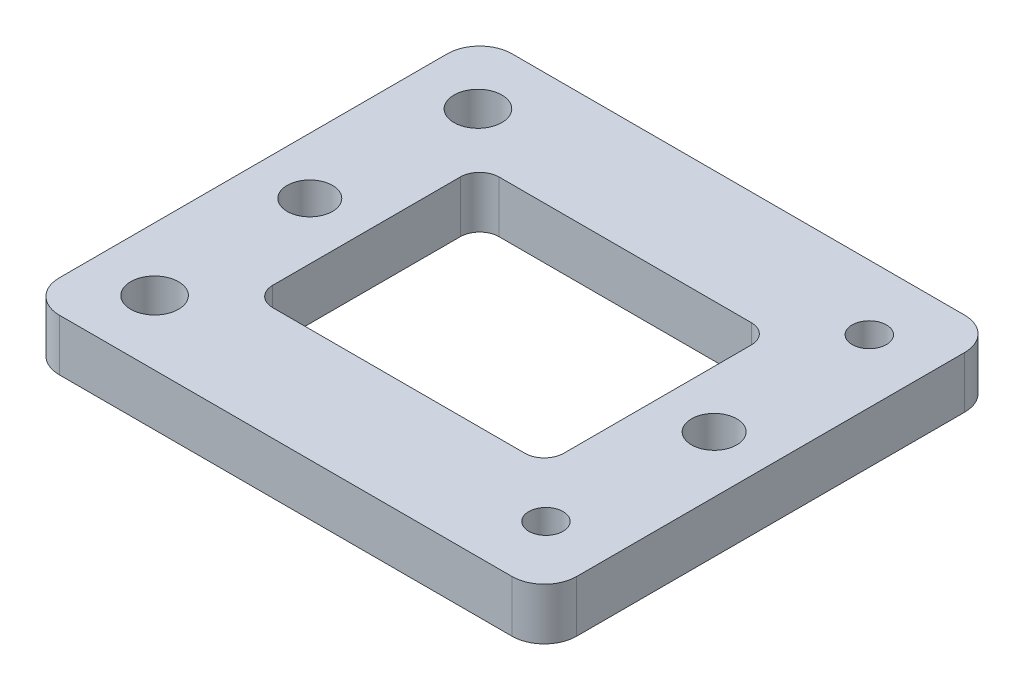
ISO-10303-21;
HEADER;
FILE_DESCRIPTION(('STEP AP214'),'2;1');
FILE_NAME('part.step','',(''),(''),'','','');
FILE_SCHEMA(('AUTOMOTIVE_DESIGN { 1 0 10303 214 1 1 1 1 }'));
ENDSEC;
DATA;
#1=APPLICATION_CONTEXT('core data for automotive mechanical design processes');
#2=APPLICATION_PROTOCOL_DEFINITION('international standard','automotive_design',2000,#1);
#3=PRODUCT_CONTEXT('',#1,'mechanical');
#4=PRODUCT('Part','Part','',(#3));
#5=PRODUCT_RELATED_PRODUCT_CATEGORY('part','',(#4));
#6=PRODUCT_DEFINITION_FORMATION('','',#4);
#7=PRODUCT_DEFINITION_CONTEXT('part definition',#1,'design');
#8=PRODUCT_DEFINITION('design','',#6,#7);
#9=PRODUCT_DEFINITION_SHAPE('','',#8);
#10=(LENGTH_UNIT() NAMED_UNIT(*) SI_UNIT(.MILLI.,.METRE.));
#11=(NAMED_UNIT(*) PLANE_ANGLE_UNIT() SI_UNIT($,.RADIAN.));
#12=(NAMED_UNIT(*) SI_UNIT($,.STERADIAN.) SOLID_ANGLE_UNIT());
#13=UNCERTAINTY_MEASURE_WITH_UNIT(LENGTH_MEASURE(1.E-05),#10,'distance_accuracy_value','');
#14=(GEOMETRIC_REPRESENTATION_CONTEXT(3) GLOBAL_UNCERTAINTY_ASSIGNED_CONTEXT((#13)) GLOBAL_UNIT_ASSIGNED_CONTEXT((#10,
#11,#12)) REPRESENTATION_CONTEXT('',''));
#15=CARTESIAN_POINT('',(0.,0.,0.));
#16=DIRECTION('',(0.,0.,1.));
#17=DIRECTION('',(1.,0.,0.));
#18=AXIS2_PLACEMENT_3D('',#15,#16,#17);
#19=CARTESIAN_POINT('',(19.5,8.,14.5));
#20=DIRECTION('',(0.,-1.,0.));
#21=DIRECTION('',(0.,0.,-1.));
#22=AXIS2_PLACEMENT_3D('',#19,#20,#21);
#23=CYLINDRICAL_SURFACE('',#22,3.00000000000002);
#24=CARTESIAN_POINT('',(19.5,0.,14.5));
#25=DIRECTION('',(0.,1.,0.));
#26=DIRECTION('',(0.,0.,1.));
#27=AXIS2_PLACEMENT_3D('',#24,#25,#26);
#28=CIRCLE('',#27,3.00000000000002);
#29=CARTESIAN_POINT('',(19.5,0.,17.5));
#30=VERTEX_POINT('',#29);
#31=CARTESIAN_POINT('',(22.5,0.,14.5));
#32=VERTEX_POINT('',#31);
#33=EDGE_CURVE('E224',#30,#32,#28,.T.);
#34=ORIENTED_EDGE('',*,*,#33,.F.);
#35=DIRECTION('',(0.,-1.,0.));
#36=VECTOR('',#35,1.);
#37=CARTESIAN_POINT('',(19.5,8.,17.5));
#38=LINE('',#37,#36);
#39=CARTESIAN_POINT('',(19.5,8.,17.5));
#40=VERTEX_POINT('',#39);
#41=EDGE_CURVE('E11',#40,#30,#38,.T.);
#42=ORIENTED_EDGE('',*,*,#41,.F.);
#43=CARTESIAN_POINT('',(19.5,8.,14.5));
#44=DIRECTION('',(0.,1.,0.));
#45=DIRECTION('',(0.,0.,1.));
#46=AXIS2_PLACEMENT_3D('',#43,#44,#45);
#47=CIRCLE('',#46,3.00000000000002);
#48=CARTESIAN_POINT('',(22.5,8.,14.5));
#49=VERTEX_POINT('',#48);
#50=EDGE_CURVE('E538',#40,#49,#47,.T.);
#51=ORIENTED_EDGE('',*,*,#50,.T.);
#52=DIRECTION('',(0.,-1.,0.));
#53=VECTOR('',#52,1.);
#54=CARTESIAN_POINT('',(22.5,8.,14.5));
#55=LINE('',#54,#53);
#56=EDGE_CURVE('E112',#49,#32,#55,.T.);
#57=ORIENTED_EDGE('',*,*,#56,.T.);
#58=EDGE_LOOP('',(#34,#42,#51,#57));
#59=FACE_BOUND('',#58,.T.);
#60=ADVANCED_FACE('F35',(#59),#23,.F.);
#61=CARTESIAN_POINT('',(0.,8.,17.5));
#62=DIRECTION('',(0.,0.,-1.));
#63=DIRECTION('',(-1.,0.,0.));
#64=AXIS2_PLACEMENT_3D('',#61,#62,#63);
#65=PLANE('',#64);
#66=DIRECTION('',(1.,0.,0.));
#67=VECTOR('',#66,1.);
#68=CARTESIAN_POINT('',(0.,0.,17.5));
#69=LINE('',#68,#67);
#70=CARTESIAN_POINT('',(-19.4999999999999,0.,17.5));
#71=VERTEX_POINT('',#70);
#72=EDGE_CURVE('E227',#71,#30,#69,.T.);
#73=ORIENTED_EDGE('',*,*,#72,.F.);
#74=DIRECTION('',(0.,-1.,0.));
#75=VECTOR('',#74,1.);
#76=CARTESIAN_POINT('',(-19.4999999999999,8.,17.5));
#77=LINE('',#76,#75);
#78=CARTESIAN_POINT('',(-19.4999999999999,8.,17.5));
#79=VERTEX_POINT('',#78);
#80=EDGE_CURVE('E45',#79,#71,#77,.T.);
#81=ORIENTED_EDGE('',*,*,#80,.F.);
#82=DIRECTION('',(1.,0.,0.));
#83=VECTOR('',#82,1.);
#84=CARTESIAN_POINT('',(0.,8.,17.5));
#85=LINE('',#84,#83);
#86=EDGE_CURVE('E533',#79,#40,#85,.T.);
#87=ORIENTED_EDGE('',*,*,#86,.T.);
#88=ORIENTED_EDGE('',*,*,#41,.T.);
#89=EDGE_LOOP('',(#73,#81,#87,#88));
#90=FACE_BOUND('',#89,.T.);
#91=ADVANCED_FACE('F314',(#90),#65,.T.);
#92=CARTESIAN_POINT('',(-19.4999999999999,8.,14.4999999999999));
#93=DIRECTION('',(0.,-1.,0.));
#94=DIRECTION('',(0.,0.,-1.));
#95=AXIS2_PLACEMENT_3D('',#92,#93,#94);
#96=CYLINDRICAL_SURFACE('',#95,3.00000000000006);
#97=CARTESIAN_POINT('',(-19.4999999999999,0.,14.4999999999999));
#98=DIRECTION('',(0.,1.,0.));
#99=DIRECTION('',(0.,0.,1.));
#100=AXIS2_PLACEMENT_3D('',#97,#98,#99);
#101=CIRCLE('',#100,3.00000000000006);
#102=CARTESIAN_POINT('',(-22.5,0.,14.4999999999999));
#103=VERTEX_POINT('',#102);
#104=EDGE_CURVE('E230',#71,#103,#101,.F.);
#105=ORIENTED_EDGE('',*,*,#104,.T.);
#106=DIRECTION('',(0.,-1.,0.));
#107=VECTOR('',#106,1.);
#108=CARTESIAN_POINT('',(-22.5,8.,14.4999999999999));
#109=LINE('',#108,#107);
#110=CARTESIAN_POINT('',(-22.5,8.,14.4999999999999));
#111=VERTEX_POINT('',#110);
#112=EDGE_CURVE('E250',#111,#103,#109,.T.);
#113=ORIENTED_EDGE('',*,*,#112,.F.);
#114=CARTESIAN_POINT('',(-19.4999999999999,8.,14.4999999999999));
#115=DIRECTION('',(0.,1.,0.));
#116=DIRECTION('',(0.,0.,1.));
#117=AXIS2_PLACEMENT_3D('',#114,#115,#116);
#118=CIRCLE('',#117,3.00000000000006);
#119=EDGE_CURVE('E531',#79,#111,#118,.F.);
#120=ORIENTED_EDGE('',*,*,#119,.F.);
#121=ORIENTED_EDGE('',*,*,#80,.T.);
#122=EDGE_LOOP('',(#105,#113,#120,#121));
#123=FACE_BOUND('',#122,.T.);
#124=ADVANCED_FACE('F319',(#123),#96,.F.);
#125=CARTESIAN_POINT('',(-22.5,8.,0.));
#126=DIRECTION('',(1.,0.,0.));
#127=DIRECTION('',(0.,0.,-1.));
#128=AXIS2_PLACEMENT_3D('',#125,#126,#127);
#129=PLANE('',#128);
#130=DIRECTION('',(0.,0.,1.));
#131=VECTOR('',#130,1.);
#132=CARTESIAN_POINT('',(-22.5,0.,0.));
#133=LINE('',#132,#131);
#134=CARTESIAN_POINT('',(-22.5,0.,-14.5));
#135=VERTEX_POINT('',#134);
#136=EDGE_CURVE('E233',#135,#103,#133,.T.);
#137=ORIENTED_EDGE('',*,*,#136,.F.);
#138=DIRECTION('',(0.,-1.,0.));
#139=VECTOR('',#138,1.);
#140=CARTESIAN_POINT('',(-22.5,8.,-14.5));
#141=LINE('',#140,#139);
#142=CARTESIAN_POINT('',(-22.5,8.,-14.5));
#143=VERTEX_POINT('',#142);
#144=EDGE_CURVE('E248',#143,#135,#141,.T.);
#145=ORIENTED_EDGE('',*,*,#144,.F.);
#146=DIRECTION('',(0.,0.,1.));
#147=VECTOR('',#146,1.);
#148=CARTESIAN_POINT('',(-22.5,8.,0.));
#149=LINE('',#148,#147);
#150=EDGE_CURVE('E530',#143,#111,#149,.T.);
#151=ORIENTED_EDGE('',*,*,#150,.T.);
#152=ORIENTED_EDGE('',*,*,#112,.T.);
#153=EDGE_LOOP('',(#137,#145,#151,#152));
#154=FACE_BOUND('',#153,.T.);
#155=ADVANCED_FACE('F487',(#154),#129,.T.);
#156=CARTESIAN_POINT('',(-19.5,8.,-14.5));
#157=DIRECTION('',(0.,-1.,0.));
#158=DIRECTION('',(0.,0.,-1.));
#159=AXIS2_PLACEMENT_3D('',#156,#157,#158);
#160=CYLINDRICAL_SURFACE('',#159,3.00000000000001);
#161=CARTESIAN_POINT('',(-19.5,0.,-14.5));
#162=DIRECTION('',(0.,1.,0.));
#163=DIRECTION('',(0.,0.,1.));
#164=AXIS2_PLACEMENT_3D('',#161,#162,#163);
#165=CIRCLE('',#164,3.00000000000001);
#166=CARTESIAN_POINT('',(-19.5,0.,-17.5));
#167=VERTEX_POINT('',#166);
#168=EDGE_CURVE('E236',#167,#135,#165,.T.);
#169=ORIENTED_EDGE('',*,*,#168,.F.);
#170=DIRECTION('',(0.,-1.,0.));
#171=VECTOR('',#170,1.);
#172=CARTESIAN_POINT('',(-19.5,8.,-17.5));
#173=LINE('',#172,#171);
#174=CARTESIAN_POINT('',(-19.5,8.,-17.5));
#175=VERTEX_POINT('',#174);
#176=EDGE_CURVE('E176',#175,#167,#173,.T.);
#177=ORIENTED_EDGE('',*,*,#176,.F.);
#178=CARTESIAN_POINT('',(-19.5,8.,-14.5));
#179=DIRECTION('',(0.,1.,0.));
#180=DIRECTION('',(0.,0.,1.));
#181=AXIS2_PLACEMENT_3D('',#178,#179,#180);
#182=CIRCLE('',#181,3.00000000000001);
#183=EDGE_CURVE('E165',#175,#143,#182,.T.);
#184=ORIENTED_EDGE('',*,*,#183,.T.);
#185=ORIENTED_EDGE('',*,*,#144,.T.);
#186=EDGE_LOOP('',(#169,#177,#184,#185));
#187=FACE_BOUND('',#186,.T.);
#188=ADVANCED_FACE('F479',(#187),#160,.F.);
#189=CARTESIAN_POINT('',(0.,8.,-17.5));
#190=DIRECTION('',(0.,0.,-1.));
#191=DIRECTION('',(-1.,0.,0.));
#192=AXIS2_PLACEMENT_3D('',#189,#190,#191);
#193=PLANE('',#192);
#194=DIRECTION('',(1.,0.,0.));
#195=VECTOR('',#194,1.);
#196=CARTESIAN_POINT('',(0.,0.,-17.5));
#197=LINE('',#196,#195);
#198=CARTESIAN_POINT('',(19.5,0.,-17.5));
#199=VERTEX_POINT('',#198);
#200=EDGE_CURVE('E172',#167,#199,#197,.T.);
#201=ORIENTED_EDGE('',*,*,#200,.T.);
#202=DIRECTION('',(0.,-1.,0.));
#203=VECTOR('',#202,1.);
#204=CARTESIAN_POINT('',(19.5,8.,-17.5));
#205=LINE('',#204,#203);
#206=CARTESIAN_POINT('',(19.5,8.,-17.5));
#207=VERTEX_POINT('',#206);
#208=EDGE_CURVE('E169',#207,#199,#205,.T.);
#209=ORIENTED_EDGE('',*,*,#208,.F.);
#210=DIRECTION('',(1.,0.,0.));
#211=VECTOR('',#210,1.);
#212=CARTESIAN_POINT('',(0.,8.,-17.5));
#213=LINE('',#212,#211);
#214=EDGE_CURVE('E158',#175,#207,#213,.T.);
#215=ORIENTED_EDGE('',*,*,#214,.F.);
#216=ORIENTED_EDGE('',*,*,#176,.T.);
#217=EDGE_LOOP('',(#201,#209,#215,#216));
#218=FACE_BOUND('',#217,.T.);
#219=ADVANCED_FACE('F170',(#218),#193,.F.);
#220=CARTESIAN_POINT('',(19.5,8.,-14.5));
#221=DIRECTION('',(0.,-1.,0.));
#222=DIRECTION('',(0.,0.,-1.));
#223=AXIS2_PLACEMENT_3D('',#220,#221,#222);
#224=CYLINDRICAL_SURFACE('',#223,3.00000000000001);
#225=CARTESIAN_POINT('',(19.5,0.,-14.5));
#226=DIRECTION('',(0.,1.,0.));
#227=DIRECTION('',(0.,0.,1.));
#228=AXIS2_PLACEMENT_3D('',#225,#226,#227);
#229=CIRCLE('',#228,3.00000000000001);
#230=CARTESIAN_POINT('',(22.5,0.,-14.5));
#231=VERTEX_POINT('',#230);
#232=EDGE_CURVE('E240',#231,#199,#229,.T.);
#233=ORIENTED_EDGE('',*,*,#232,.F.);
#234=DIRECTION('',(0.,-1.,0.));
#235=VECTOR('',#234,1.);
#236=CARTESIAN_POINT('',(22.5,8.,-14.5));
#237=LINE('',#236,#235);
#238=CARTESIAN_POINT('',(22.5,8.,-14.5));
#239=VERTEX_POINT('',#238);
#240=EDGE_CURVE('E105',#239,#231,#237,.T.);
#241=ORIENTED_EDGE('',*,*,#240,.F.);
#242=CARTESIAN_POINT('',(19.5,8.,-14.5));
#243=DIRECTION('',(0.,1.,0.));
#244=DIRECTION('',(0.,0.,1.));
#245=AXIS2_PLACEMENT_3D('',#242,#243,#244);
#246=CIRCLE('',#245,3.00000000000001);
#247=EDGE_CURVE('E162',#239,#207,#246,.T.);
#248=ORIENTED_EDGE('',*,*,#247,.T.);
#249=ORIENTED_EDGE('',*,*,#208,.T.);
#250=EDGE_LOOP('',(#233,#241,#248,#249));
#251=FACE_BOUND('',#250,.T.);
#252=ADVANCED_FACE('F178',(#251),#224,.F.);
#253=CARTESIAN_POINT('',(35.,8.,30.));
#254=DIRECTION('',(0.,-1.,0.));
#255=DIRECTION('',(0.,0.,-1.));
#256=AXIS2_PLACEMENT_3D('',#253,#254,#255);
#257=CYLINDRICAL_SURFACE('',#256,5.);
#258=CARTESIAN_POINT('',(35.,0.,30.));
#259=DIRECTION('',(0.,1.,0.));
#260=DIRECTION('',(0.,0.,1.));
#261=AXIS2_PLACEMENT_3D('',#258,#259,#260);
#262=CIRCLE('',#261,5.);
#263=CARTESIAN_POINT('',(40.,0.,30.));
#264=VERTEX_POINT('',#263);
#265=CARTESIAN_POINT('',(35.,0.,35.));
#266=VERTEX_POINT('',#265);
#267=EDGE_CURVE('E184',#264,#266,#262,.F.);
#268=ORIENTED_EDGE('',*,*,#267,.F.);
#269=DIRECTION('',(0.,-1.,0.));
#270=VECTOR('',#269,1.);
#271=CARTESIAN_POINT('',(40.,8.,30.));
#272=LINE('',#271,#270);
#273=CARTESIAN_POINT('',(40.,8.,30.));
#274=VERTEX_POINT('',#273);
#275=EDGE_CURVE('E39',#274,#264,#272,.T.);
#276=ORIENTED_EDGE('',*,*,#275,.F.);
#277=CARTESIAN_POINT('',(35.,8.,30.));
#278=DIRECTION('',(0.,1.,0.));
#279=DIRECTION('',(0.,0.,1.));
#280=AXIS2_PLACEMENT_3D('',#277,#278,#279);
#281=CIRCLE('',#280,5.);
#282=CARTESIAN_POINT('',(35.,8.,35.));
#283=VERTEX_POINT('',#282);
#284=EDGE_CURVE('E244',#274,#283,#281,.F.);
#285=ORIENTED_EDGE('',*,*,#284,.T.);
#286=DIRECTION('',(0.,-1.,0.));
#287=VECTOR('',#286,1.);
#288=CARTESIAN_POINT('',(35.,8.,35.));
#289=LINE('',#288,#287);
#290=EDGE_CURVE('E180',#283,#266,#289,.T.);
#291=ORIENTED_EDGE('',*,*,#290,.T.);
#292=EDGE_LOOP('',(#268,#276,#285,#291));
#293=FACE_BOUND('',#292,.T.);
#294=ADVANCED_FACE('F37',(#293),#257,.T.);
#295=CARTESIAN_POINT('',(40.,8.,0.));
#296=DIRECTION('',(-1.,0.,0.));
#297=DIRECTION('',(0.,0.,1.));
#298=AXIS2_PLACEMENT_3D('',#295,#296,#297);
#299=PLANE('',#298);
#300=DIRECTION('',(0.,0.,-1.));
#301=VECTOR('',#300,1.);
#302=CARTESIAN_POINT('',(40.,0.,0.));
#303=LINE('',#302,#301);
#304=CARTESIAN_POINT('',(40.,0.,-30.));
#305=VERTEX_POINT('',#304);
#306=EDGE_CURVE('E187',#264,#305,#303,.T.);
#307=ORIENTED_EDGE('',*,*,#306,.T.);
#308=DIRECTION('',(0.,-1.,0.));
#309=VECTOR('',#308,1.);
#310=CARTESIAN_POINT('',(40.,8.,-30.));
#311=LINE('',#310,#309);
#312=CARTESIAN_POINT('',(40.,8.,-30.));
#313=VERTEX_POINT('',#312);
#314=EDGE_CURVE('E264',#313,#305,#311,.T.);
#315=ORIENTED_EDGE('',*,*,#314,.F.);
#316=DIRECTION('',(0.,0.,-1.));
#317=VECTOR('',#316,1.);
#318=CARTESIAN_POINT('',(40.,8.,0.));
#319=LINE('',#318,#317);
#320=EDGE_CURVE('E273',#274,#313,#319,.T.);
#321=ORIENTED_EDGE('',*,*,#320,.F.);
#322=ORIENTED_EDGE('',*,*,#275,.T.);
#323=EDGE_LOOP('',(#307,#315,#321,#322));
#324=FACE_BOUND('',#323,.T.);
#325=ADVANCED_FACE('F272',(#324),#299,.F.);
#326=CARTESIAN_POINT('',(35.,8.,-30.));
#327=DIRECTION('',(0.,-1.,0.));
#328=DIRECTION('',(0.,0.,-1.));
#329=AXIS2_PLACEMENT_3D('',#326,#327,#328);
#330=CYLINDRICAL_SURFACE('',#329,5.);
#331=CARTESIAN_POINT('',(35.,0.,-30.));
#332=DIRECTION('',(0.,1.,0.));
#333=DIRECTION('',(0.,0.,1.));
#334=AXIS2_PLACEMENT_3D('',#331,#332,#333);
#335=CIRCLE('',#334,5.);
#336=CARTESIAN_POINT('',(35.,0.,-35.));
#337=VERTEX_POINT('',#336);
#338=EDGE_CURVE('E189',#305,#337,#335,.T.);
#339=ORIENTED_EDGE('',*,*,#338,.T.);
#340=DIRECTION('',(0.,-1.,0.));
#341=VECTOR('',#340,1.);
#342=CARTESIAN_POINT('',(35.,8.,-35.));
#343=LINE('',#342,#341);
#344=CARTESIAN_POINT('',(35.,8.,-35.));
#345=VERTEX_POINT('',#344);
#346=EDGE_CURVE('E263',#345,#337,#343,.T.);
#347=ORIENTED_EDGE('',*,*,#346,.F.);
#348=CARTESIAN_POINT('',(35.,8.,-30.));
#349=DIRECTION('',(0.,1.,0.));
#350=DIRECTION('',(0.,0.,1.));
#351=AXIS2_PLACEMENT_3D('',#348,#349,#350);
#352=CIRCLE('',#351,5.);
#353=EDGE_CURVE('E566',#313,#345,#352,.T.);
#354=ORIENTED_EDGE('',*,*,#353,.F.);
#355=ORIENTED_EDGE('',*,*,#314,.T.);
#356=EDGE_LOOP('',(#339,#347,#354,#355));
#357=FACE_BOUND('',#356,.T.);
#358=ADVANCED_FACE('F305',(#357),#330,.T.);
#359=CARTESIAN_POINT('',(0.,8.,-35.));
#360=DIRECTION('',(0.,0.,-1.));
#361=DIRECTION('',(-1.,0.,0.));
#362=AXIS2_PLACEMENT_3D('',#359,#360,#361);
#363=PLANE('',#362);
#364=DIRECTION('',(1.,0.,0.));
#365=VECTOR('',#364,1.);
#366=CARTESIAN_POINT('',(0.,0.,-35.));
#367=LINE('',#366,#365);
#368=CARTESIAN_POINT('',(-35.,0.,-35.));
#369=VERTEX_POINT('',#368);
#370=EDGE_CURVE('E192',#369,#337,#367,.T.);
#371=ORIENTED_EDGE('',*,*,#370,.F.);
#372=DIRECTION('',(0.,-1.,0.));
#373=VECTOR('',#372,1.);
#374=CARTESIAN_POINT('',(-35.,8.,-35.));
#375=LINE('',#374,#373);
#376=CARTESIAN_POINT('',(-35.,8.,-35.));
#377=VERTEX_POINT('',#376);
#378=EDGE_CURVE('E261',#377,#369,#375,.T.);
#379=ORIENTED_EDGE('',*,*,#378,.F.);
#380=DIRECTION('',(1.,0.,0.));
#381=VECTOR('',#380,1.);
#382=CARTESIAN_POINT('',(0.,8.,-35.));
#383=LINE('',#382,#381);
#384=EDGE_CURVE('E304',#377,#345,#383,.T.);
#385=ORIENTED_EDGE('',*,*,#384,.T.);
#386=ORIENTED_EDGE('',*,*,#346,.T.);
#387=EDGE_LOOP('',(#371,#379,#385,#386));
#388=FACE_BOUND('',#387,.T.);
#389=ADVANCED_FACE('F300',(#388),#363,.T.);
#390=CARTESIAN_POINT('',(-35.,8.,-30.));
#391=DIRECTION('',(0.,-1.,0.));
#392=DIRECTION('',(0.,0.,-1.));
#393=AXIS2_PLACEMENT_3D('',#390,#391,#392);
#394=CYLINDRICAL_SURFACE('',#393,5.);
#395=CARTESIAN_POINT('',(-35.,0.,-30.));
#396=DIRECTION('',(0.,1.,0.));
#397=DIRECTION('',(0.,0.,1.));
#398=AXIS2_PLACEMENT_3D('',#395,#396,#397);
#399=CIRCLE('',#398,5.);
#400=CARTESIAN_POINT('',(-40.,0.,-30.));
#401=VERTEX_POINT('',#400);
#402=EDGE_CURVE('E195',#401,#369,#399,.F.);
#403=ORIENTED_EDGE('',*,*,#402,.F.);
#404=DIRECTION('',(0.,-1.,0.));
#405=VECTOR('',#404,1.);
#406=CARTESIAN_POINT('',(-40.,8.,-30.));
#407=LINE('',#406,#405);
#408=CARTESIAN_POINT('',(-40.,8.,-30.));
#409=VERTEX_POINT('',#408);
#410=EDGE_CURVE('E259',#409,#401,#407,.T.);
#411=ORIENTED_EDGE('',*,*,#410,.F.);
#412=CARTESIAN_POINT('',(-35.,8.,-30.));
#413=DIRECTION('',(0.,1.,0.));
#414=DIRECTION('',(0.,0.,1.));
#415=AXIS2_PLACEMENT_3D('',#412,#413,#414);
#416=CIRCLE('',#415,5.);
#417=EDGE_CURVE('E563',#409,#377,#416,.F.);
#418=ORIENTED_EDGE('',*,*,#417,.T.);
#419=ORIENTED_EDGE('',*,*,#378,.T.);
#420=EDGE_LOOP('',(#403,#411,#418,#419));
#421=FACE_BOUND('',#420,.T.);
#422=ADVANCED_FACE('F297',(#421),#394,.T.);
#423=CARTESIAN_POINT('',(-40.,8.,0.));
#424=DIRECTION('',(-1.,0.,0.));
#425=DIRECTION('',(0.,0.,1.));
#426=AXIS2_PLACEMENT_3D('',#423,#424,#425);
#427=PLANE('',#426);
#428=DIRECTION('',(0.,0.,-1.));
#429=VECTOR('',#428,1.);
#430=CARTESIAN_POINT('',(-40.,0.,0.));
#431=LINE('',#430,#429);
#432=CARTESIAN_POINT('',(-40.,0.,30.));
#433=VERTEX_POINT('',#432);
#434=EDGE_CURVE('E198',#433,#401,#431,.T.);
#435=ORIENTED_EDGE('',*,*,#434,.F.);
#436=DIRECTION('',(0.,-1.,0.));
#437=VECTOR('',#436,1.);
#438=CARTESIAN_POINT('',(-40.,8.,30.));
#439=LINE('',#438,#437);
#440=CARTESIAN_POINT('',(-40.,8.,30.));
#441=VERTEX_POINT('',#440);
#442=EDGE_CURVE('E257',#441,#433,#439,.T.);
#443=ORIENTED_EDGE('',*,*,#442,.F.);
#444=DIRECTION('',(0.,0.,-1.));
#445=VECTOR('',#444,1.);
#446=CARTESIAN_POINT('',(-40.,8.,0.));
#447=LINE('',#446,#445);
#448=EDGE_CURVE('E293',#441,#409,#447,.T.);
#449=ORIENTED_EDGE('',*,*,#448,.T.);
#450=ORIENTED_EDGE('',*,*,#410,.T.);
#451=EDGE_LOOP('',(#435,#443,#449,#450));
#452=FACE_BOUND('',#451,.T.);
#453=ADVANCED_FACE('F288',(#452),#427,.T.);
#454=CARTESIAN_POINT('',(-35.,8.,30.));
#455=DIRECTION('',(0.,-1.,0.));
#456=DIRECTION('',(0.,0.,-1.));
#457=AXIS2_PLACEMENT_3D('',#454,#455,#456);
#458=CYLINDRICAL_SURFACE('',#457,4.99999999999999);
#459=CARTESIAN_POINT('',(-35.,0.,30.));
#460=DIRECTION('',(0.,1.,0.));
#461=DIRECTION('',(0.,0.,1.));
#462=AXIS2_PLACEMENT_3D('',#459,#460,#461);
#463=CIRCLE('',#462,4.99999999999999);
#464=CARTESIAN_POINT('',(-35.,0.,35.));
#465=VERTEX_POINT('',#464);
#466=EDGE_CURVE('E201',#433,#465,#463,.T.);
#467=ORIENTED_EDGE('',*,*,#466,.T.);
#468=DIRECTION('',(0.,-1.,0.));
#469=VECTOR('',#468,1.);
#470=CARTESIAN_POINT('',(-35.,8.,35.));
#471=LINE('',#470,#469);
#472=CARTESIAN_POINT('',(-35.,8.,35.));
#473=VERTEX_POINT('',#472);
#474=EDGE_CURVE('E254',#473,#465,#471,.T.);
#475=ORIENTED_EDGE('',*,*,#474,.F.);
#476=CARTESIAN_POINT('',(-35.,8.,30.));
#477=DIRECTION('',(0.,1.,0.));
#478=DIRECTION('',(0.,0.,1.));
#479=AXIS2_PLACEMENT_3D('',#476,#477,#478);
#480=CIRCLE('',#479,4.99999999999999);
#481=EDGE_CURVE('E560',#441,#473,#480,.T.);
#482=ORIENTED_EDGE('',*,*,#481,.F.);
#483=ORIENTED_EDGE('',*,*,#442,.T.);
#484=EDGE_LOOP('',(#467,#475,#482,#483));
#485=FACE_BOUND('',#484,.T.);
#486=ADVANCED_FACE('F328',(#485),#458,.T.);
#487=CARTESIAN_POINT('',(-30.2641200042906,8.,25.00224));
#488=DIRECTION('',(0.,-1.,0.));
#489=DIRECTION('',(0.,0.,-1.));
#490=AXIS2_PLACEMENT_3D('',#487,#488,#489);
#491=CYLINDRICAL_SURFACE('',#490,3.7);
#492=CARTESIAN_POINT('',(-30.2641200042906,8.,25.00224));
#493=DIRECTION('',(0.,1.,0.));
#494=DIRECTION('',(0.,0.,1.));
#495=AXIS2_PLACEMENT_3D('',#492,#493,#494);
#496=CIRCLE('',#495,3.7);
#497=CARTESIAN_POINT('',(-30.2641200042906,8.,28.70224));
#498=VERTEX_POINT('',#497);
#499=EDGE_CURVE('E540',#498,#498,#496,.T.);
#500=ORIENTED_EDGE('',*,*,#499,.T.);
#501=EDGE_LOOP('',(#500));
#502=FACE_BOUND('',#501,.T.);
#503=CARTESIAN_POINT('',(-30.2641200042906,0.,25.00224));
#504=DIRECTION('',(0.,1.,0.));
#505=DIRECTION('',(0.,0.,1.));
#506=AXIS2_PLACEMENT_3D('',#503,#504,#505);
#507=CIRCLE('',#506,3.7);
#508=CARTESIAN_POINT('',(-30.2641200042906,0.,28.70224));
#509=VERTEX_POINT('',#508);
#510=EDGE_CURVE('E221',#509,#509,#507,.T.);
#511=ORIENTED_EDGE('',*,*,#510,.F.);
#512=EDGE_LOOP('',(#511));
#513=FACE_BOUND('',#512,.T.);
#514=ADVANCED_FACE('F324',(#502,#513),#491,.F.);
#515=CARTESIAN_POINT('',(-30.2641200042906,8.,-24.99741));
#516=DIRECTION('',(0.,-1.,0.));
#517=DIRECTION('',(0.,0.,-1.));
#518=AXIS2_PLACEMENT_3D('',#515,#516,#517);
#519=CYLINDRICAL_SURFACE('',#518,3.7);
#520=CARTESIAN_POINT('',(-30.2641200042906,8.,-24.99741));
#521=DIRECTION('',(0.,1.,0.));
#522=DIRECTION('',(0.,0.,1.));
#523=AXIS2_PLACEMENT_3D('',#520,#521,#522);
#524=CIRCLE('',#523,3.7);
#525=CARTESIAN_POINT('',(-30.2641200042906,8.,-21.29741));
#526=VERTEX_POINT('',#525);
#527=EDGE_CURVE('E543',#526,#526,#524,.T.);
#528=ORIENTED_EDGE('',*,*,#527,.T.);
#529=EDGE_LOOP('',(#528));
#530=FACE_BOUND('',#529,.T.);
#531=CARTESIAN_POINT('',(-30.2641200042906,0.,-24.99741));
#532=DIRECTION('',(0.,1.,0.));
#533=DIRECTION('',(0.,0.,1.));
#534=AXIS2_PLACEMENT_3D('',#531,#532,#533);
#535=CIRCLE('',#534,3.7);
#536=CARTESIAN_POINT('',(-30.2641200042906,0.,-21.29741));
#537=VERTEX_POINT('',#536);
#538=EDGE_CURVE('E218',#537,#537,#535,.T.);
#539=ORIENTED_EDGE('',*,*,#538,.F.);
#540=EDGE_LOOP('',(#539));
#541=FACE_BOUND('',#540,.T.);
#542=ADVANCED_FACE('F327',(#530,#541),#519,.F.);
#543=CARTESIAN_POINT('',(-31.263846279205,8.,0.));
#544=DIRECTION('',(0.,-1.,0.));
#545=DIRECTION('',(0.,0.,-1.));
#546=AXIS2_PLACEMENT_3D('',#543,#544,#545);
#547=CYLINDRICAL_SURFACE('',#546,3.5);
#548=CARTESIAN_POINT('',(-31.263846279205,8.,0.));
#549=DIRECTION('',(0.,1.,0.));
#550=DIRECTION('',(0.,0.,1.));
#551=AXIS2_PLACEMENT_3D('',#548,#549,#550);
#552=CIRCLE('',#551,3.5);
#553=CARTESIAN_POINT('',(-31.263846279205,8.,3.50000000000003));
#554=VERTEX_POINT('',#553);
#555=EDGE_CURVE('E546',#554,#554,#552,.T.);
#556=ORIENTED_EDGE('',*,*,#555,.T.);
#557=EDGE_LOOP('',(#556));
#558=FACE_BOUND('',#557,.T.);
#559=CARTESIAN_POINT('',(-31.263846279205,0.,0.));
#560=DIRECTION('',(0.,1.,0.));
#561=DIRECTION('',(0.,0.,1.));
#562=AXIS2_PLACEMENT_3D('',#559,#560,#561);
#563=CIRCLE('',#562,3.5);
#564=CARTESIAN_POINT('',(-31.263846279205,0.,3.50000000000003));
#565=VERTEX_POINT('',#564);
#566=EDGE_CURVE('E215',#565,#565,#563,.T.);
#567=ORIENTED_EDGE('',*,*,#566,.F.);
#568=EDGE_LOOP('',(#567));
#569=FACE_BOUND('',#568,.T.);
#570=ADVANCED_FACE('F332',(#558,#569),#547,.F.);
#571=CARTESIAN_POINT('',(30.25001,8.,25.));
#572=DIRECTION('',(0.,-1.,0.));
#573=DIRECTION('',(0.,0.,-1.));
#574=AXIS2_PLACEMENT_3D('',#571,#572,#573);
#575=CYLINDRICAL_SURFACE('',#574,2.65);
#576=CARTESIAN_POINT('',(30.25001,8.,25.));
#577=DIRECTION('',(0.,1.,0.));
#578=DIRECTION('',(0.,0.,1.));
#579=AXIS2_PLACEMENT_3D('',#576,#577,#578);
#580=CIRCLE('',#579,2.65);
#581=CARTESIAN_POINT('',(30.25001,8.,27.65));
#582=VERTEX_POINT('',#581);
#583=EDGE_CURVE('E549',#582,#582,#580,.T.);
#584=ORIENTED_EDGE('',*,*,#583,.T.);
#585=EDGE_LOOP('',(#584));
#586=FACE_BOUND('',#585,.T.);
#587=CARTESIAN_POINT('',(30.25001,0.,25.));
#588=DIRECTION('',(0.,1.,0.));
#589=DIRECTION('',(0.,0.,1.));
#590=AXIS2_PLACEMENT_3D('',#587,#588,#589);
#591=CIRCLE('',#590,2.65);
#592=CARTESIAN_POINT('',(30.25001,0.,27.65));
#593=VERTEX_POINT('',#592);
#594=EDGE_CURVE('E212',#593,#593,#591,.T.);
#595=ORIENTED_EDGE('',*,*,#594,.F.);
#596=EDGE_LOOP('',(#595));
#597=FACE_BOUND('',#596,.T.);
#598=ADVANCED_FACE('F336',(#586,#597),#575,.F.);
#599=CARTESIAN_POINT('',(30.25001,8.,-25.));
#600=DIRECTION('',(0.,-1.,0.));
#601=DIRECTION('',(0.,0.,-1.));
#602=AXIS2_PLACEMENT_3D('',#599,#600,#601);
#603=CYLINDRICAL_SURFACE('',#602,2.65);
#604=CARTESIAN_POINT('',(30.25001,8.,-25.));
#605=DIRECTION('',(0.,1.,0.));
#606=DIRECTION('',(0.,0.,1.));
#607=AXIS2_PLACEMENT_3D('',#604,#605,#606);
#608=CIRCLE('',#607,2.65);
#609=CARTESIAN_POINT('',(30.25001,8.,-22.35));
#610=VERTEX_POINT('',#609);
#611=EDGE_CURVE('E552',#610,#610,#608,.T.);
#612=ORIENTED_EDGE('',*,*,#611,.T.);
#613=EDGE_LOOP('',(#612));
#614=FACE_BOUND('',#613,.T.);
#615=CARTESIAN_POINT('',(30.25001,0.,-25.));
#616=DIRECTION('',(0.,1.,0.));
#617=DIRECTION('',(0.,0.,1.));
#618=AXIS2_PLACEMENT_3D('',#615,#616,#617);
#619=CIRCLE('',#618,2.65);
#620=CARTESIAN_POINT('',(30.25001,0.,-22.35));
#621=VERTEX_POINT('',#620);
#622=EDGE_CURVE('E209',#621,#621,#619,.T.);
#623=ORIENTED_EDGE('',*,*,#622,.F.);
#624=EDGE_LOOP('',(#623));
#625=FACE_BOUND('',#624,.T.);
#626=ADVANCED_FACE('F340',(#614,#625),#603,.F.);
#627=CARTESIAN_POINT('',(31.2591696220445,8.,0.));
#628=DIRECTION('',(0.,-1.,0.));
#629=DIRECTION('',(0.,0.,-1.));
#630=AXIS2_PLACEMENT_3D('',#627,#628,#629);
#631=CYLINDRICAL_SURFACE('',#630,3.5);
#632=CARTESIAN_POINT('',(31.2591696220445,8.,0.));
#633=DIRECTION('',(0.,1.,0.));
#634=DIRECTION('',(0.,0.,1.));
#635=AXIS2_PLACEMENT_3D('',#632,#633,#634);
#636=CIRCLE('',#635,3.5);
#637=CARTESIAN_POINT('',(31.2591696220445,8.,3.5));
#638=VERTEX_POINT('',#637);
#639=EDGE_CURVE('E555',#638,#638,#636,.T.);
#640=ORIENTED_EDGE('',*,*,#639,.T.);
#641=EDGE_LOOP('',(#640));
#642=FACE_BOUND('',#641,.T.);
#643=CARTESIAN_POINT('',(31.2591696220445,0.,0.));
#644=DIRECTION('',(0.,1.,0.));
#645=DIRECTION('',(0.,0.,1.));
#646=AXIS2_PLACEMENT_3D('',#643,#644,#645);
#647=CIRCLE('',#646,3.5);
#648=CARTESIAN_POINT('',(31.2591696220445,0.,3.5));
#649=VERTEX_POINT('',#648);
#650=EDGE_CURVE('E206',#649,#649,#647,.T.);
#651=ORIENTED_EDGE('',*,*,#650,.F.);
#652=EDGE_LOOP('',(#651));
#653=FACE_BOUND('',#652,.T.);
#654=ADVANCED_FACE('F344',(#642,#653),#631,.F.);
#655=CARTESIAN_POINT('',(0.,8.,35.));
#656=DIRECTION('',(0.,0.,-1.));
#657=DIRECTION('',(-1.,0.,0.));
#658=AXIS2_PLACEMENT_3D('',#655,#656,#657);
#659=PLANE('',#658);
#660=DIRECTION('',(1.,0.,0.));
#661=VECTOR('',#660,1.);
#662=CARTESIAN_POINT('',(0.,0.,35.));
#663=LINE('',#662,#661);
#664=EDGE_CURVE('E203',#465,#266,#663,.T.);
#665=ORIENTED_EDGE('',*,*,#664,.T.);
#666=ORIENTED_EDGE('',*,*,#290,.F.);
#667=DIRECTION('',(1.,0.,0.));
#668=VECTOR('',#667,1.);
#669=CARTESIAN_POINT('',(0.,8.,35.));
#670=LINE('',#669,#668);
#671=EDGE_CURVE('E558',#473,#283,#670,.T.);
#672=ORIENTED_EDGE('',*,*,#671,.F.);
#673=ORIENTED_EDGE('',*,*,#474,.T.);
#674=EDGE_LOOP('',(#665,#666,#672,#673));
#675=FACE_BOUND('',#674,.T.);
#676=ADVANCED_FACE('F282',(#675),#659,.F.);
#677=CARTESIAN_POINT('',(22.5,8.,0.));
#678=DIRECTION('',(1.,0.,0.));
#679=DIRECTION('',(0.,0.,-1.));
#680=AXIS2_PLACEMENT_3D('',#677,#678,#679);
#681=PLANE('',#680);
#682=DIRECTION('',(0.,0.,1.));
#683=VECTOR('',#682,1.);
#684=CARTESIAN_POINT('',(22.5,0.,0.));
#685=LINE('',#684,#683);
#686=EDGE_CURVE('E242',#231,#32,#685,.T.);
#687=ORIENTED_EDGE('',*,*,#686,.T.);
#688=ORIENTED_EDGE('',*,*,#56,.F.);
#689=DIRECTION('',(0.,0.,1.));
#690=VECTOR('',#689,1.);
#691=CARTESIAN_POINT('',(22.5,8.,0.));
#692=LINE('',#691,#690);
#693=EDGE_CURVE('E54',#239,#49,#692,.T.);
#694=ORIENTED_EDGE('',*,*,#693,.F.);
#695=ORIENTED_EDGE('',*,*,#240,.T.);
#696=EDGE_LOOP('',(#687,#688,#694,#695));
#697=FACE_BOUND('',#696,.T.);
#698=ADVANCED_FACE('F351',(#697),#681,.F.);
#699=CARTESIAN_POINT('',(0.,8.,0.));
#700=DIRECTION('',(0.,1.,0.));
#701=DIRECTION('',(0.,0.,1.));
#702=AXIS2_PLACEMENT_3D('',#699,#700,#701);
#703=PLANE('',#702);
#704=ORIENTED_EDGE('',*,*,#284,.F.);
#705=ORIENTED_EDGE('',*,*,#320,.T.);
#706=ORIENTED_EDGE('',*,*,#353,.T.);
#707=ORIENTED_EDGE('',*,*,#384,.F.);
#708=ORIENTED_EDGE('',*,*,#417,.F.);
#709=ORIENTED_EDGE('',*,*,#448,.F.);
#710=ORIENTED_EDGE('',*,*,#481,.T.);
#711=ORIENTED_EDGE('',*,*,#671,.T.);
#712=EDGE_LOOP('',(#704,#705,#706,#707,#708,#709,#710,#711));
#713=FACE_BOUND('',#712,.T.);
#714=ORIENTED_EDGE('',*,*,#639,.F.);
#715=EDGE_LOOP('',(#714));
#716=FACE_BOUND('',#715,.T.);
#717=ORIENTED_EDGE('',*,*,#611,.F.);
#718=EDGE_LOOP('',(#717));
#719=FACE_BOUND('',#718,.T.);
#720=ORIENTED_EDGE('',*,*,#583,.F.);
#721=EDGE_LOOP('',(#720));
#722=FACE_BOUND('',#721,.T.);
#723=ORIENTED_EDGE('',*,*,#555,.F.);
#724=EDGE_LOOP('',(#723));
#725=FACE_BOUND('',#724,.T.);
#726=ORIENTED_EDGE('',*,*,#527,.F.);
#727=EDGE_LOOP('',(#726));
#728=FACE_BOUND('',#727,.T.);
#729=ORIENTED_EDGE('',*,*,#499,.F.);
#730=EDGE_LOOP('',(#729));
#731=FACE_BOUND('',#730,.T.);
#732=ORIENTED_EDGE('',*,*,#50,.F.);
#733=ORIENTED_EDGE('',*,*,#86,.F.);
#734=ORIENTED_EDGE('',*,*,#119,.T.);
#735=ORIENTED_EDGE('',*,*,#150,.F.);
#736=ORIENTED_EDGE('',*,*,#183,.F.);
#737=ORIENTED_EDGE('',*,*,#214,.T.);
#738=ORIENTED_EDGE('',*,*,#247,.F.);
#739=ORIENTED_EDGE('',*,*,#693,.T.);
#740=EDGE_LOOP('',(#732,#733,#734,#735,#736,#737,#738,#739));
#741=FACE_BOUND('',#740,.T.);
#742=ADVANCED_FACE('F160',(#713,#716,#719,#722,#725,#728,#731,#741),#703,.T.);
#743=CARTESIAN_POINT('',(0.,0.,0.));
#744=DIRECTION('',(0.,1.,0.));
#745=DIRECTION('',(0.,0.,1.));
#746=AXIS2_PLACEMENT_3D('',#743,#744,#745);
#747=PLANE('',#746);
#748=ORIENTED_EDGE('',*,*,#267,.T.);
#749=ORIENTED_EDGE('',*,*,#664,.F.);
#750=ORIENTED_EDGE('',*,*,#466,.F.);
#751=ORIENTED_EDGE('',*,*,#434,.T.);
#752=ORIENTED_EDGE('',*,*,#402,.T.);
#753=ORIENTED_EDGE('',*,*,#370,.T.);
#754=ORIENTED_EDGE('',*,*,#338,.F.);
#755=ORIENTED_EDGE('',*,*,#306,.F.);
#756=EDGE_LOOP('',(#748,#749,#750,#751,#752,#753,#754,#755));
#757=FACE_BOUND('',#756,.T.);
#758=ORIENTED_EDGE('',*,*,#650,.T.);
#759=EDGE_LOOP('',(#758));
#760=FACE_BOUND('',#759,.T.);
#761=ORIENTED_EDGE('',*,*,#622,.T.);
#762=EDGE_LOOP('',(#761));
#763=FACE_BOUND('',#762,.T.);
#764=ORIENTED_EDGE('',*,*,#594,.T.);
#765=EDGE_LOOP('',(#764));
#766=FACE_BOUND('',#765,.T.);
#767=ORIENTED_EDGE('',*,*,#566,.T.);
#768=EDGE_LOOP('',(#767));
#769=FACE_BOUND('',#768,.T.);
#770=ORIENTED_EDGE('',*,*,#538,.T.);
#771=EDGE_LOOP('',(#770));
#772=FACE_BOUND('',#771,.T.);
#773=ORIENTED_EDGE('',*,*,#510,.T.);
#774=EDGE_LOOP('',(#773));
#775=FACE_BOUND('',#774,.T.);
#776=ORIENTED_EDGE('',*,*,#33,.T.);
#777=ORIENTED_EDGE('',*,*,#686,.F.);
#778=ORIENTED_EDGE('',*,*,#232,.T.);
#779=ORIENTED_EDGE('',*,*,#200,.F.);
#780=ORIENTED_EDGE('',*,*,#168,.T.);
#781=ORIENTED_EDGE('',*,*,#136,.T.);
#782=ORIENTED_EDGE('',*,*,#104,.F.);
#783=ORIENTED_EDGE('',*,*,#72,.T.);
#784=EDGE_LOOP('',(#776,#777,#778,#779,#780,#781,#782,#783));
#785=FACE_BOUND('',#784,.T.);
#786=ADVANCED_FACE('F276',(#757,#760,#763,#766,#769,#772,#775,#785),#747,.F.);
#787=CLOSED_SHELL('',(#60,#91,#124,#155,#188,#219,#252,#294,#325,#358,#389,#422,#453,#486,#514,
#542,#570,#598,#626,#654,#676,#698,#742,#786));
#788=MANIFOLD_SOLID_BREP('B2',#787);
#789=ADVANCED_BREP_SHAPE_REPRESENTATION('',(#18,#788),#14);
#790=SHAPE_DEFINITION_REPRESENTATION(#9,#789);
ENDSEC;
END-ISO-10303-21;
